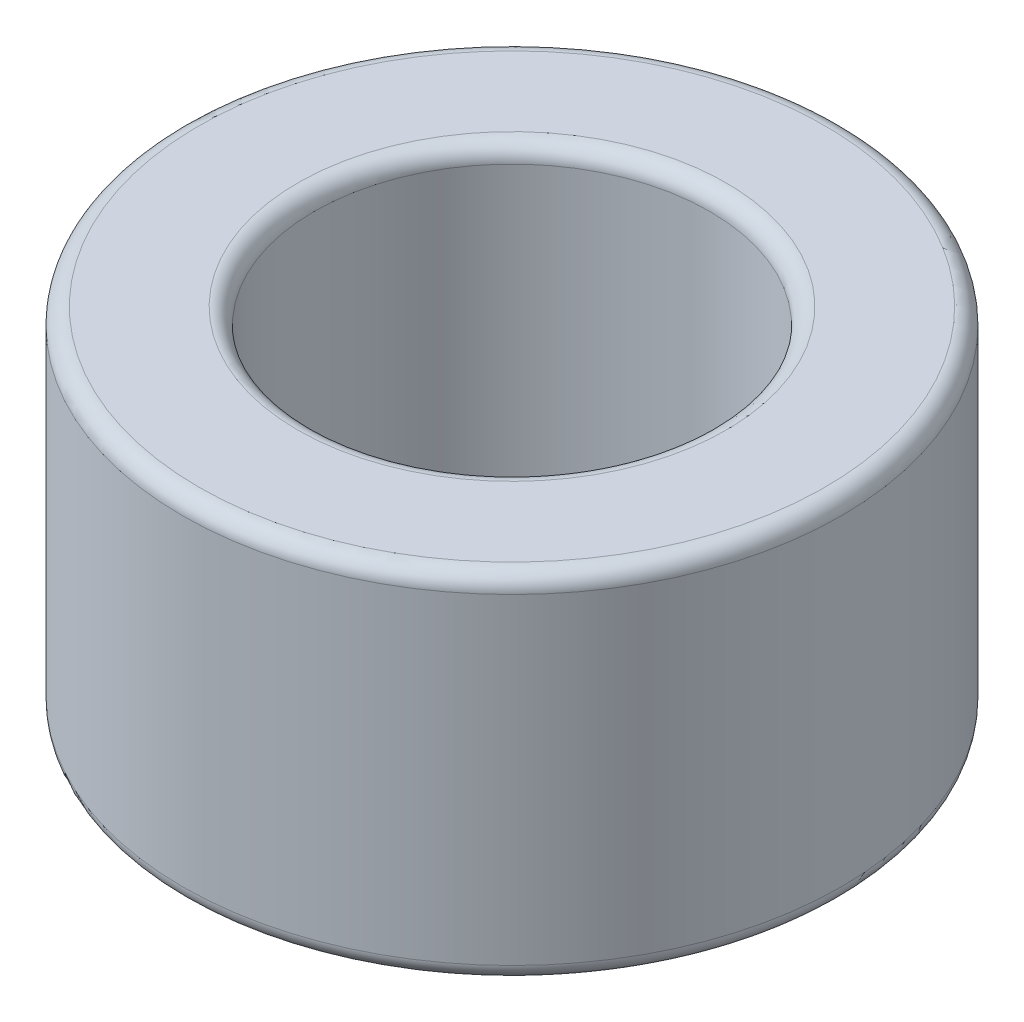
ISO-10303-21;
HEADER;
FILE_DESCRIPTION(('STEP AP214'),'2;1');
FILE_NAME('part.step','',(''),(''),'','','');
FILE_SCHEMA(('AUTOMOTIVE_DESIGN { 1 0 10303 214 1 1 1 1 }'));
ENDSEC;
DATA;
#1=APPLICATION_CONTEXT('core data for automotive mechanical design processes');
#2=APPLICATION_PROTOCOL_DEFINITION('international standard','automotive_design',2000,#1);
#3=PRODUCT_CONTEXT('',#1,'mechanical');
#4=PRODUCT('Part','Part','',(#3));
#5=PRODUCT_RELATED_PRODUCT_CATEGORY('part','',(#4));
#6=PRODUCT_DEFINITION_FORMATION('','',#4);
#7=PRODUCT_DEFINITION_CONTEXT('part definition',#1,'design');
#8=PRODUCT_DEFINITION('design','',#6,#7);
#9=PRODUCT_DEFINITION_SHAPE('','',#8);
#10=(LENGTH_UNIT() NAMED_UNIT(*) SI_UNIT(.MILLI.,.METRE.));
#11=(NAMED_UNIT(*) PLANE_ANGLE_UNIT() SI_UNIT($,.RADIAN.));
#12=(NAMED_UNIT(*) SI_UNIT($,.STERADIAN.) SOLID_ANGLE_UNIT());
#13=UNCERTAINTY_MEASURE_WITH_UNIT(LENGTH_MEASURE(1.E-05),#10,'distance_accuracy_value','');
#14=(GEOMETRIC_REPRESENTATION_CONTEXT(3) GLOBAL_UNCERTAINTY_ASSIGNED_CONTEXT((#13)) GLOBAL_UNIT_ASSIGNED_CONTEXT((#10,
#11,#12)) REPRESENTATION_CONTEXT('',''));
#15=CARTESIAN_POINT('',(0.,0.,0.));
#16=DIRECTION('',(0.,0.,1.));
#17=DIRECTION('',(1.,0.,0.));
#18=AXIS2_PLACEMENT_3D('',#15,#16,#17);
#19=CARTESIAN_POINT('',(0.,4.3,0.));
#20=DIRECTION('',(0.,1.,0.));
#21=DIRECTION('',(0.,0.,1.));
#22=AXIS2_PLACEMENT_3D('',#19,#20,#21);
#23=PLANE('',#22);
#24=CARTESIAN_POINT('',(0.,4.3,0.));
#25=DIRECTION('',(0.,1.,0.));
#26=DIRECTION('',(0.,0.,1.));
#27=AXIS2_PLACEMENT_3D('',#24,#25,#26);
#28=CIRCLE('',#27,2.6);
#29=CARTESIAN_POINT('',(0.,4.3,2.6));
#30=VERTEX_POINT('',#29);
#31=EDGE_CURVE('E10',#30,#30,#28,.F.);
#32=ORIENTED_EDGE('',*,*,#31,.T.);
#33=EDGE_LOOP('',(#32));
#34=FACE_BOUND('',#33,.T.);
#35=CARTESIAN_POINT('',(0.,4.3,0.));
#36=DIRECTION('',(0.,1.,0.));
#37=DIRECTION('',(0.,0.,1.));
#38=AXIS2_PLACEMENT_3D('',#35,#36,#37);
#39=CIRCLE('',#38,3.8);
#40=CARTESIAN_POINT('',(0.,4.3,3.8));
#41=VERTEX_POINT('',#40);
#42=EDGE_CURVE('E43',#41,#41,#39,.T.);
#43=ORIENTED_EDGE('',*,*,#42,.T.);
#44=EDGE_LOOP('',(#43));
#45=FACE_BOUND('',#44,.T.);
#46=ADVANCED_FACE('F36',(#34,#45),#23,.T.);
#47=CARTESIAN_POINT('',(0.,0.,0.));
#48=DIRECTION('',(0.,1.,0.));
#49=DIRECTION('',(0.,0.,1.));
#50=AXIS2_PLACEMENT_3D('',#47,#48,#49);
#51=PLANE('',#50);
#52=CARTESIAN_POINT('',(0.,0.,0.));
#53=DIRECTION('',(0.,1.,0.));
#54=DIRECTION('',(0.,0.,1.));
#55=AXIS2_PLACEMENT_3D('',#52,#53,#54);
#56=CIRCLE('',#55,2.6);
#57=CARTESIAN_POINT('',(0.,0.,2.6));
#58=VERTEX_POINT('',#57);
#59=EDGE_CURVE('E62',#58,#58,#56,.T.);
#60=ORIENTED_EDGE('',*,*,#59,.T.);
#61=EDGE_LOOP('',(#60));
#62=FACE_BOUND('',#61,.T.);
#63=CARTESIAN_POINT('',(0.,0.,0.));
#64=DIRECTION('',(0.,1.,0.));
#65=DIRECTION('',(0.,0.,1.));
#66=AXIS2_PLACEMENT_3D('',#63,#64,#65);
#67=CIRCLE('',#66,3.8);
#68=CARTESIAN_POINT('',(0.,0.,3.8));
#69=VERTEX_POINT('',#68);
#70=EDGE_CURVE('E65',#69,#69,#67,.F.);
#71=ORIENTED_EDGE('',*,*,#70,.T.);
#72=EDGE_LOOP('',(#71));
#73=FACE_BOUND('',#72,.T.);
#74=ADVANCED_FACE('F69',(#62,#73),#51,.F.);
#75=CARTESIAN_POINT('',(0.,4.3,0.));
#76=DIRECTION('',(0.,-1.,0.));
#77=DIRECTION('',(0.,0.,-1.));
#78=AXIS2_PLACEMENT_3D('',#75,#76,#77);
#79=CYLINDRICAL_SURFACE('',#78,4.);
#80=CARTESIAN_POINT('',(0.,0.2,0.));
#81=DIRECTION('',(0.,1.,0.));
#82=DIRECTION('',(0.,0.,1.));
#83=AXIS2_PLACEMENT_3D('',#80,#81,#82);
#84=CIRCLE('',#83,4.);
#85=CARTESIAN_POINT('',(0.,0.2,4.));
#86=VERTEX_POINT('',#85);
#87=EDGE_CURVE('E47',#86,#86,#84,.T.);
#88=ORIENTED_EDGE('',*,*,#87,.T.);
#89=EDGE_LOOP('',(#88));
#90=FACE_BOUND('',#89,.T.);
#91=CARTESIAN_POINT('',(0.,4.1,0.));
#92=DIRECTION('',(0.,1.,0.));
#93=DIRECTION('',(0.,0.,1.));
#94=AXIS2_PLACEMENT_3D('',#91,#92,#93);
#95=CIRCLE('',#94,4.);
#96=CARTESIAN_POINT('',(0.,4.1,4.));
#97=VERTEX_POINT('',#96);
#98=EDGE_CURVE('E51',#97,#97,#95,.F.);
#99=ORIENTED_EDGE('',*,*,#98,.T.);
#100=EDGE_LOOP('',(#99));
#101=FACE_BOUND('',#100,.T.);
#102=ADVANCED_FACE('F79',(#90,#101),#79,.T.);
#103=CARTESIAN_POINT('',(0.,4.3,0.));
#104=DIRECTION('',(0.,-1.,0.));
#105=DIRECTION('',(0.,0.,-1.));
#106=AXIS2_PLACEMENT_3D('',#103,#104,#105);
#107=CYLINDRICAL_SURFACE('',#106,2.4);
#108=CARTESIAN_POINT('',(0.,0.2,0.));
#109=DIRECTION('',(0.,1.,0.));
#110=DIRECTION('',(0.,0.,1.));
#111=AXIS2_PLACEMENT_3D('',#108,#109,#110);
#112=CIRCLE('',#111,2.4);
#113=CARTESIAN_POINT('',(0.,0.2,2.4));
#114=VERTEX_POINT('',#113);
#115=EDGE_CURVE('E56',#114,#114,#112,.F.);
#116=ORIENTED_EDGE('',*,*,#115,.T.);
#117=EDGE_LOOP('',(#116));
#118=FACE_BOUND('',#117,.T.);
#119=CARTESIAN_POINT('',(0.,4.1,0.));
#120=DIRECTION('',(0.,1.,0.));
#121=DIRECTION('',(0.,0.,1.));
#122=AXIS2_PLACEMENT_3D('',#119,#120,#121);
#123=CIRCLE('',#122,2.4);
#124=CARTESIAN_POINT('',(0.,4.1,2.4));
#125=VERTEX_POINT('',#124);
#126=EDGE_CURVE('E59',#125,#125,#123,.T.);
#127=ORIENTED_EDGE('',*,*,#126,.T.);
#128=EDGE_LOOP('',(#127));
#129=FACE_BOUND('',#128,.T.);
#130=ADVANCED_FACE('F82',(#118,#129),#107,.F.);
#131=CARTESIAN_POINT('',(0.,0.2,0.));
#132=DIRECTION('',(0.,1.,0.));
#133=DIRECTION('',(0.,0.,1.));
#134=AXIS2_PLACEMENT_3D('',#131,#132,#133);
#135=TOROIDAL_SURFACE('',#134,2.6,0.2);
#136=ORIENTED_EDGE('',*,*,#115,.F.);
#137=EDGE_LOOP('',(#136));
#138=FACE_BOUND('',#137,.T.);
#139=ORIENTED_EDGE('',*,*,#59,.F.);
#140=EDGE_LOOP('',(#139));
#141=FACE_BOUND('',#140,.T.);
#142=ADVANCED_FACE('F75',(#138,#141),#135,.T.);
#143=CARTESIAN_POINT('',(0.,0.2,0.));
#144=DIRECTION('',(0.,1.,0.));
#145=DIRECTION('',(0.,0.,1.));
#146=AXIS2_PLACEMENT_3D('',#143,#144,#145);
#147=TOROIDAL_SURFACE('',#146,3.8,0.2);
#148=ORIENTED_EDGE('',*,*,#70,.F.);
#149=EDGE_LOOP('',(#148));
#150=FACE_BOUND('',#149,.T.);
#151=ORIENTED_EDGE('',*,*,#87,.F.);
#152=EDGE_LOOP('',(#151));
#153=FACE_BOUND('',#152,.T.);
#154=ADVANCED_FACE('F71',(#150,#153),#147,.T.);
#155=CARTESIAN_POINT('',(0.,4.1,0.));
#156=DIRECTION('',(0.,1.,0.));
#157=DIRECTION('',(0.,0.,1.));
#158=AXIS2_PLACEMENT_3D('',#155,#156,#157);
#159=TOROIDAL_SURFACE('',#158,2.6,0.2);
#160=ORIENTED_EDGE('',*,*,#31,.F.);
#161=EDGE_LOOP('',(#160));
#162=FACE_BOUND('',#161,.T.);
#163=ORIENTED_EDGE('',*,*,#126,.F.);
#164=EDGE_LOOP('',(#163));
#165=FACE_BOUND('',#164,.T.);
#166=ADVANCED_FACE('F74',(#162,#165),#159,.T.);
#167=CARTESIAN_POINT('',(0.,4.1,0.));
#168=DIRECTION('',(0.,1.,0.));
#169=DIRECTION('',(0.,0.,1.));
#170=AXIS2_PLACEMENT_3D('',#167,#168,#169);
#171=TOROIDAL_SURFACE('',#170,3.8,0.2);
#172=ORIENTED_EDGE('',*,*,#98,.F.);
#173=EDGE_LOOP('',(#172));
#174=FACE_BOUND('',#173,.T.);
#175=ORIENTED_EDGE('',*,*,#42,.F.);
#176=EDGE_LOOP('',(#175));
#177=FACE_BOUND('',#176,.T.);
#178=ADVANCED_FACE('F38',(#174,#177),#171,.T.);
#179=CLOSED_SHELL('',(#46,#74,#102,#130,#142,#154,#166,#178));
#180=MANIFOLD_SOLID_BREP('B2',#179);
#181=ADVANCED_BREP_SHAPE_REPRESENTATION('',(#18,#180),#14);
#182=SHAPE_DEFINITION_REPRESENTATION(#9,#181);
ENDSEC;
END-ISO-10303-21;
